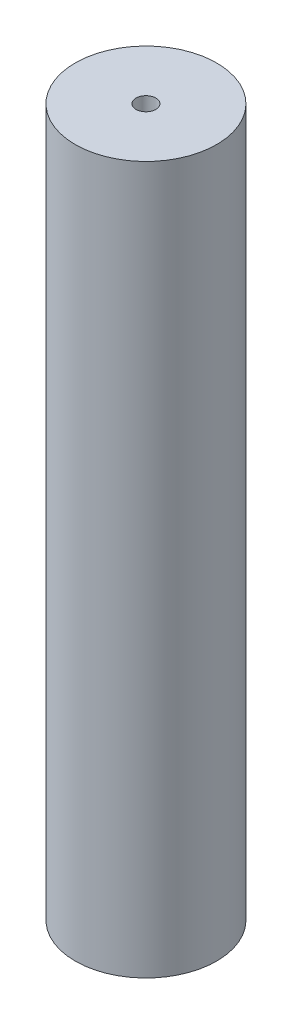
ISO-10303-21;
HEADER;
FILE_DESCRIPTION(('STEP AP214'),'2;1');
FILE_NAME('part.step','',(''),(''),'','','');
FILE_SCHEMA(('AUTOMOTIVE_DESIGN { 1 0 10303 214 1 1 1 1 }'));
ENDSEC;
DATA;
#1=APPLICATION_CONTEXT('core data for automotive mechanical design processes');
#2=APPLICATION_PROTOCOL_DEFINITION('international standard','automotive_design',2000,#1);
#3=PRODUCT_CONTEXT('',#1,'mechanical');
#4=PRODUCT('Part','Part','',(#3));
#5=PRODUCT_RELATED_PRODUCT_CATEGORY('part','',(#4));
#6=PRODUCT_DEFINITION_FORMATION('','',#4);
#7=PRODUCT_DEFINITION_CONTEXT('part definition',#1,'design');
#8=PRODUCT_DEFINITION('design','',#6,#7);
#9=PRODUCT_DEFINITION_SHAPE('','',#8);
#10=(LENGTH_UNIT() NAMED_UNIT(*) SI_UNIT(.MILLI.,.METRE.));
#11=(NAMED_UNIT(*) PLANE_ANGLE_UNIT() SI_UNIT($,.RADIAN.));
#12=(NAMED_UNIT(*) SI_UNIT($,.STERADIAN.) SOLID_ANGLE_UNIT());
#13=UNCERTAINTY_MEASURE_WITH_UNIT(LENGTH_MEASURE(1.E-05),#10,'distance_accuracy_value','');
#14=(GEOMETRIC_REPRESENTATION_CONTEXT(3) GLOBAL_UNCERTAINTY_ASSIGNED_CONTEXT((#13)) GLOBAL_UNIT_ASSIGNED_CONTEXT((#10,
#11,#12)) REPRESENTATION_CONTEXT('',''));
#15=CARTESIAN_POINT('',(0.,0.,0.));
#16=DIRECTION('',(0.,0.,1.));
#17=DIRECTION('',(1.,0.,0.));
#18=AXIS2_PLACEMENT_3D('',#15,#16,#17);
#19=CARTESIAN_POINT('',(-1.37502517769348,25.,-1.38576756189421));
#20=DIRECTION('',(0.,1.,0.));
#21=DIRECTION('',(0.,0.,1.));
#22=AXIS2_PLACEMENT_3D('',#19,#20,#21);
#23=PLANE('',#22);
#24=CARTESIAN_POINT('',(-1.37502517769348,25.,-1.38576756189421));
#25=DIRECTION('',(0.,1.,0.));
#26=DIRECTION('',(0.,0.,1.));
#27=AXIS2_PLACEMENT_3D('',#24,#25,#26);
#28=CIRCLE('',#27,2.5);
#29=CARTESIAN_POINT('',(-1.37502517769348,25.,1.11423243810579));
#30=VERTEX_POINT('',#29);
#31=EDGE_CURVE('E10',#30,#30,#28,.T.);
#32=ORIENTED_EDGE('',*,*,#31,.T.);
#33=EDGE_LOOP('',(#32));
#34=FACE_BOUND('',#33,.T.);
#35=CARTESIAN_POINT('',(-1.37502517769348,25.,-1.38576756189421));
#36=DIRECTION('',(0.,1.,0.));
#37=DIRECTION('',(0.,0.,1.));
#38=AXIS2_PLACEMENT_3D('',#35,#36,#37);
#39=CIRCLE('',#38,0.35);
#40=CARTESIAN_POINT('',(-1.37502517769348,25.,-1.03576756189421));
#41=VERTEX_POINT('',#40);
#42=EDGE_CURVE('E50',#41,#41,#39,.T.);
#43=ORIENTED_EDGE('',*,*,#42,.F.);
#44=EDGE_LOOP('',(#43));
#45=FACE_BOUND('',#44,.T.);
#46=ADVANCED_FACE('F39',(#34,#45),#23,.T.);
#47=CARTESIAN_POINT('',(-1.37502517769348,0.,-1.38576756189421));
#48=DIRECTION('',(0.,1.,0.));
#49=DIRECTION('',(0.,0.,1.));
#50=AXIS2_PLACEMENT_3D('',#47,#48,#49);
#51=PLANE('',#50);
#52=CARTESIAN_POINT('',(-1.37502517769348,0.,-1.38576756189421));
#53=DIRECTION('',(0.,1.,0.));
#54=DIRECTION('',(0.,0.,1.));
#55=AXIS2_PLACEMENT_3D('',#52,#53,#54);
#56=CIRCLE('',#55,2.5);
#57=CARTESIAN_POINT('',(-1.37502517769348,0.,1.11423243810579));
#58=VERTEX_POINT('',#57);
#59=EDGE_CURVE('E43',#58,#58,#56,.T.);
#60=ORIENTED_EDGE('',*,*,#59,.F.);
#61=EDGE_LOOP('',(#60));
#62=FACE_BOUND('',#61,.T.);
#63=CARTESIAN_POINT('',(-1.37502517769348,0.,-1.38576756189421));
#64=DIRECTION('',(0.,1.,0.));
#65=DIRECTION('',(0.,0.,1.));
#66=AXIS2_PLACEMENT_3D('',#63,#64,#65);
#67=CIRCLE('',#66,0.35);
#68=CARTESIAN_POINT('',(-1.37502517769348,0.,-1.03576756189421));
#69=VERTEX_POINT('',#68);
#70=EDGE_CURVE('E52',#69,#69,#67,.T.);
#71=ORIENTED_EDGE('',*,*,#70,.T.);
#72=EDGE_LOOP('',(#71));
#73=FACE_BOUND('',#72,.T.);
#74=ADVANCED_FACE('F62',(#62,#73),#51,.F.);
#75=CARTESIAN_POINT('',(-1.37502517769348,25.,-1.38576756189421));
#76=DIRECTION('',(0.,-1.,0.));
#77=DIRECTION('',(0.,0.,-1.));
#78=AXIS2_PLACEMENT_3D('',#75,#76,#77);
#79=CYLINDRICAL_SURFACE('',#78,2.5);
#80=ORIENTED_EDGE('',*,*,#31,.F.);
#81=EDGE_LOOP('',(#80));
#82=FACE_BOUND('',#81,.T.);
#83=ORIENTED_EDGE('',*,*,#59,.T.);
#84=EDGE_LOOP('',(#83));
#85=FACE_BOUND('',#84,.T.);
#86=ADVANCED_FACE('F41',(#82,#85),#79,.T.);
#87=CARTESIAN_POINT('',(-1.37502517769348,25.,-1.38576756189421));
#88=DIRECTION('',(0.,-1.,0.));
#89=DIRECTION('',(0.,0.,-1.));
#90=AXIS2_PLACEMENT_3D('',#87,#88,#89);
#91=CYLINDRICAL_SURFACE('',#90,0.35);
#92=ORIENTED_EDGE('',*,*,#42,.T.);
#93=EDGE_LOOP('',(#92));
#94=FACE_BOUND('',#93,.T.);
#95=ORIENTED_EDGE('',*,*,#70,.F.);
#96=EDGE_LOOP('',(#95));
#97=FACE_BOUND('',#96,.T.);
#98=ADVANCED_FACE('F58',(#94,#97),#91,.F.);
#99=CLOSED_SHELL('',(#46,#74,#86,#98));
#100=MANIFOLD_SOLID_BREP('B2',#99);
#101=ADVANCED_BREP_SHAPE_REPRESENTATION('',(#18,#100),#14);
#102=SHAPE_DEFINITION_REPRESENTATION(#9,#101);
ENDSEC;
END-ISO-10303-21;
